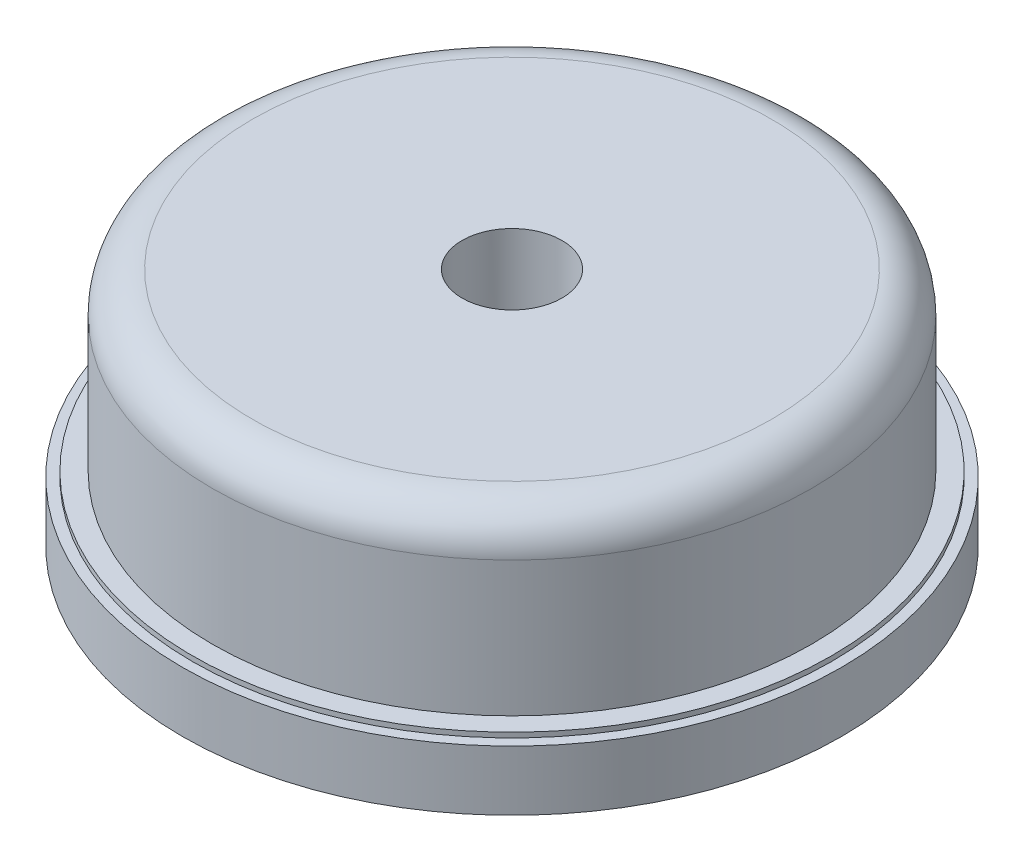
ISO-10303-21;
HEADER;
FILE_DESCRIPTION(('STEP AP214'),'2;1');
FILE_NAME('part.step','',(''),(''),'','','');
FILE_SCHEMA(('AUTOMOTIVE_DESIGN { 1 0 10303 214 1 1 1 1 }'));
ENDSEC;
DATA;
#1=APPLICATION_CONTEXT('core data for automotive mechanical design processes');
#2=APPLICATION_PROTOCOL_DEFINITION('international standard','automotive_design',2000,#1);
#3=PRODUCT_CONTEXT('',#1,'mechanical');
#4=PRODUCT('Part','Part','',(#3));
#5=PRODUCT_RELATED_PRODUCT_CATEGORY('part','',(#4));
#6=PRODUCT_DEFINITION_FORMATION('','',#4);
#7=PRODUCT_DEFINITION_CONTEXT('part definition',#1,'design');
#8=PRODUCT_DEFINITION('design','',#6,#7);
#9=PRODUCT_DEFINITION_SHAPE('','',#8);
#10=(LENGTH_UNIT() NAMED_UNIT(*) SI_UNIT(.MILLI.,.METRE.));
#11=(NAMED_UNIT(*) PLANE_ANGLE_UNIT() SI_UNIT($,.RADIAN.));
#12=(NAMED_UNIT(*) SI_UNIT($,.STERADIAN.) SOLID_ANGLE_UNIT());
#13=UNCERTAINTY_MEASURE_WITH_UNIT(LENGTH_MEASURE(1.E-05),#10,'distance_accuracy_value','');
#14=(GEOMETRIC_REPRESENTATION_CONTEXT(3) GLOBAL_UNCERTAINTY_ASSIGNED_CONTEXT((#13)) GLOBAL_UNIT_ASSIGNED_CONTEXT((#10,
#11,#12)) REPRESENTATION_CONTEXT('',''));
#15=CARTESIAN_POINT('',(0.,0.,0.));
#16=DIRECTION('',(0.,0.,1.));
#17=DIRECTION('',(1.,0.,0.));
#18=AXIS2_PLACEMENT_3D('',#15,#16,#17);
#19=CARTESIAN_POINT('',(-0.7812271897135,0.,0.6242468086041));
#20=DIRECTION('',(0.,-1.,0.));
#21=DIRECTION('',(-1.,0.,0.));
#22=AXIS2_PLACEMENT_3D('',#19,#20,#21);
#23=CYLINDRICAL_SURFACE('',#22,0.05);
#24=CARTESIAN_POINT('',(-0.7812271897135,0.,0.6242468086041));
#25=DIRECTION('',(0.,-1.,0.));
#26=DIRECTION('',(-0.781227189713479,0.,0.624246808604081));
#27=AXIS2_PLACEMENT_3D('',#24,#25,#26);
#28=CIRCLE('',#27,0.05);
#29=CARTESIAN_POINT('',(-0.8202885491992,0.,0.6554591490343));
#30=VERTEX_POINT('',#29);
#31=CARTESIAN_POINT('',(-0.8062271897135,0.,0.5809455384148));
#32=VERTEX_POINT('',#31);
#33=EDGE_CURVE('E10',#30,#32,#28,.T.);
#34=ORIENTED_EDGE('',*,*,#33,.T.);
#35=DIRECTION('',(0.,-1.,0.));
#36=VECTOR('',#35,1.);
#37=CARTESIAN_POINT('',(-0.8062271897135,0.,0.5809455384148));
#38=LINE('',#37,#36);
#39=CARTESIAN_POINT('',(-0.8062271897135,-0.002,0.5809455384148));
#40=VERTEX_POINT('',#39);
#41=EDGE_CURVE('E213',#32,#40,#38,.T.);
#42=ORIENTED_EDGE('',*,*,#41,.T.);
#43=CARTESIAN_POINT('',(-0.7812271897135,-0.002,0.6242468086041));
#44=DIRECTION('',(0.,-1.,0.));
#45=DIRECTION('',(-0.781227189713479,0.,0.624246808604081));
#46=AXIS2_PLACEMENT_3D('',#43,#44,#45);
#47=CIRCLE('',#46,0.05);
#48=CARTESIAN_POINT('',(-0.8202885491992,-0.002,0.6554591490343));
#49=VERTEX_POINT('',#48);
#50=EDGE_CURVE('E280',#49,#40,#47,.T.);
#51=ORIENTED_EDGE('',*,*,#50,.F.);
#52=DIRECTION('',(-1.110223024625E-13,-1.,0.));
#53=VECTOR('',#52,1.);
#54=CARTESIAN_POINT('',(-0.8202885491992,0.,0.6554591490343));
#55=LINE('',#54,#53);
#56=EDGE_CURVE('E35',#30,#49,#55,.T.);
#57=ORIENTED_EDGE('',*,*,#56,.F.);
#58=EDGE_LOOP('',(#34,#42,#51,#57));
#59=FACE_BOUND('',#58,.T.);
#60=ADVANCED_FACE('F16',(#59),#23,.T.);
#61=CARTESIAN_POINT('',(0.,0.,0.));
#62=DIRECTION('',(0.,-1.,0.));
#63=DIRECTION('',(-1.,0.,0.));
#64=AXIS2_PLACEMENT_3D('',#61,#62,#63);
#65=CYLINDRICAL_SURFACE('',#64,0.7);
#66=CARTESIAN_POINT('',(0.,0.,0.));
#67=DIRECTION('',(0.,-1.,0.));
#68=DIRECTION('',(-0.948528137262549,0.,0.316692868282883));
#69=AXIS2_PLACEMENT_3D('',#66,#67,#68);
#70=CIRCLE('',#69,0.7);
#71=CARTESIAN_POINT('',(-0.6639696960838,0.,0.221685007798));
#72=VERTEX_POINT('',#71);
#73=CARTESIAN_POINT('',(-0.1399999999999,0.,-0.6858571279793));
#74=VERTEX_POINT('',#73);
#75=EDGE_CURVE('E391',#72,#74,#70,.T.);
#76=ORIENTED_EDGE('',*,*,#75,.F.);
#77=DIRECTION('',(0.,-1.,0.));
#78=VECTOR('',#77,1.);
#79=CARTESIAN_POINT('',(-0.6639696960838,0.,0.221685007798));
#80=LINE('',#79,#78);
#81=CARTESIAN_POINT('',(-0.6639696960838,-0.002,0.221685007798));
#82=VERTEX_POINT('',#81);
#83=EDGE_CURVE('E331',#72,#82,#80,.T.);
#84=ORIENTED_EDGE('',*,*,#83,.T.);
#85=CARTESIAN_POINT('',(0.,-0.002,0.));
#86=DIRECTION('',(0.,1.,0.));
#87=DIRECTION('',(-0.199999999999898,0.,-0.979795897113292));
#88=AXIS2_PLACEMENT_3D('',#85,#86,#87);
#89=CIRCLE('',#88,0.7);
#90=CARTESIAN_POINT('',(-0.1399999999999,-0.002,-0.6858571279793));
#91=VERTEX_POINT('',#90);
#92=EDGE_CURVE('E256',#91,#82,#89,.T.);
#93=ORIENTED_EDGE('',*,*,#92,.F.);
#94=DIRECTION('',(1.665334536938E-13,-1.,0.));
#95=VECTOR('',#94,1.);
#96=CARTESIAN_POINT('',(-0.1399999999999,0.,-0.6858571279793));
#97=LINE('',#96,#95);
#98=EDGE_CURVE('E333',#74,#91,#97,.T.);
#99=ORIENTED_EDGE('',*,*,#98,.F.);
#100=EDGE_LOOP('',(#76,#84,#93,#99));
#101=FACE_BOUND('',#100,.T.);
#102=ADVANCED_FACE('F427',(#101),#65,.F.);
#103=CARTESIAN_POINT('',(0.,0.,0.));
#104=DIRECTION('',(0.,-1.,0.));
#105=DIRECTION('',(-1.,0.,0.));
#106=AXIS2_PLACEMENT_3D('',#103,#104,#105);
#107=CYLINDRICAL_SURFACE('',#106,1.05);
#108=CARTESIAN_POINT('',(0.,0.,0.));
#109=DIRECTION('',(0.,-1.,0.));
#110=DIRECTION('',(-0.931227189339217,0.,0.364439188117007));
#111=AXIS2_PLACEMENT_3D('',#108,#109,#110);
#112=CIRCLE('',#111,1.05);
#113=CARTESIAN_POINT('',(-0.9777885488062,0.,0.3826611475228));
#114=VERTEX_POINT('',#113);
#115=CARTESIAN_POINT('',(-0.1574999999999,0.,-1.038120296497));
#116=VERTEX_POINT('',#115);
#117=EDGE_CURVE('E26',#114,#116,#112,.T.);
#118=ORIENTED_EDGE('',*,*,#117,.T.);
#119=DIRECTION('',(0.,-1.,0.));
#120=VECTOR('',#119,1.);
#121=CARTESIAN_POINT('',(-0.1574999999999,0.,-1.038120296497));
#122=LINE('',#121,#120);
#123=CARTESIAN_POINT('',(-0.1574999999999,-0.002,-1.038120296497));
#124=VERTEX_POINT('',#123);
#125=EDGE_CURVE('E319',#116,#124,#122,.T.);
#126=ORIENTED_EDGE('',*,*,#125,.T.);
#127=CARTESIAN_POINT('',(0.,-0.002,0.));
#128=DIRECTION('',(0.,-1.,0.));
#129=DIRECTION('',(-0.931227189339217,0.,0.364439188117007));
#130=AXIS2_PLACEMENT_3D('',#127,#128,#129);
#131=CIRCLE('',#130,1.05);
#132=CARTESIAN_POINT('',(-0.9777885488062,-0.002,0.3826611475228));
#133=VERTEX_POINT('',#132);
#134=EDGE_CURVE('E266',#133,#124,#131,.T.);
#135=ORIENTED_EDGE('',*,*,#134,.F.);
#136=DIRECTION('',(0.,-1.,0.));
#137=VECTOR('',#136,1.);
#138=CARTESIAN_POINT('',(-0.9777885488062,0.,0.3826611475228));
#139=LINE('',#138,#137);
#140=EDGE_CURVE('E322',#114,#133,#139,.T.);
#141=ORIENTED_EDGE('',*,*,#140,.F.);
#142=EDGE_LOOP('',(#118,#126,#135,#141));
#143=FACE_BOUND('',#142,.T.);
#144=ADVANCED_FACE('F432',(#143),#107,.T.);
#145=CARTESIAN_POINT('',(0.7113961029469,0.,0.2375196512121));
#146=DIRECTION('',(0.,-1.,0.));
#147=DIRECTION('',(-1.,0.,0.));
#148=AXIS2_PLACEMENT_3D('',#145,#146,#147);
#149=CYLINDRICAL_SURFACE('',#148,0.05);
#150=CARTESIAN_POINT('',(0.7113961029469,0.,0.2375196512121));
#151=DIRECTION('',(0.,-1.,0.));
#152=DIRECTION('',(-0.500000000000017,0.,0.866025403784429));
#153=AXIS2_PLACEMENT_3D('',#150,#151,#152);
#154=CIRCLE('',#153,0.05);
#155=CARTESIAN_POINT('',(0.6863961029469,0.,0.2808209214013));
#156=VERTEX_POINT('',#155);
#157=CARTESIAN_POINT('',(0.6639696960838,0.,0.221685007798));
#158=VERTEX_POINT('',#157);
#159=EDGE_CURVE('E348',#156,#158,#154,.T.);
#160=ORIENTED_EDGE('',*,*,#159,.T.);
#161=DIRECTION('',(0.,-1.,-2.081668171172E-13));
#162=VECTOR('',#161,1.);
#163=CARTESIAN_POINT('',(0.6639696960838,0.,0.221685007798));
#164=LINE('',#163,#162);
#165=CARTESIAN_POINT('',(0.6639696960838,-0.002,0.221685007798));
#166=VERTEX_POINT('',#165);
#167=EDGE_CURVE('E298',#158,#166,#164,.T.);
#168=ORIENTED_EDGE('',*,*,#167,.T.);
#169=CARTESIAN_POINT('',(0.7113961029469,-0.002,0.2375196512121));
#170=DIRECTION('',(0.,-1.,0.));
#171=DIRECTION('',(-0.500000000000017,0.,0.866025403784429));
#172=AXIS2_PLACEMENT_3D('',#169,#170,#171);
#173=CIRCLE('',#172,0.05);
#174=CARTESIAN_POINT('',(0.6863961029469,-0.002,0.2808209214013));
#175=VERTEX_POINT('',#174);
#176=EDGE_CURVE('E241',#175,#166,#173,.T.);
#177=ORIENTED_EDGE('',*,*,#176,.F.);
#178=DIRECTION('',(0.,-1.,0.));
#179=VECTOR('',#178,1.);
#180=CARTESIAN_POINT('',(0.6863961029469,0.,0.2808209214013));
#181=LINE('',#180,#179);
#182=EDGE_CURVE('E301',#156,#175,#181,.T.);
#183=ORIENTED_EDGE('',*,*,#182,.F.);
#184=EDGE_LOOP('',(#160,#168,#177,#183));
#185=FACE_BOUND('',#184,.T.);
#186=ADVANCED_FACE('F437',(#185),#149,.T.);
#187=CARTESIAN_POINT('',(0.,0.,0.));
#188=DIRECTION('',(0.,-1.,0.));
#189=DIRECTION('',(-1.,0.,0.));
#190=AXIS2_PLACEMENT_3D('',#187,#188,#189);
#191=CYLINDRICAL_SURFACE('',#190,0.35);
#192=CARTESIAN_POINT('',(0.,-0.002,0.));
#193=DIRECTION('',(0.,-1.,0.));
#194=DIRECTION('',(-1.,0.,0.));
#195=AXIS2_PLACEMENT_3D('',#192,#193,#194);
#196=CIRCLE('',#195,0.35);
#197=CARTESIAN_POINT('',(-0.35,-0.002,0.));
#198=VERTEX_POINT('',#197);
#199=EDGE_CURVE('E234',#198,#198,#196,.T.);
#200=ORIENTED_EDGE('',*,*,#199,.F.);
#201=EDGE_LOOP('',(#200));
#202=FACE_BOUND('',#201,.T.);
#203=CARTESIAN_POINT('',(0.,0.,0.));
#204=DIRECTION('',(0.,-1.,0.));
#205=DIRECTION('',(1.,0.,0.));
#206=AXIS2_PLACEMENT_3D('',#203,#204,#205);
#207=CIRCLE('',#206,0.35);
#208=CARTESIAN_POINT('',(0.35,0.,0.));
#209=VERTEX_POINT('',#208);
#210=EDGE_CURVE('E352',#209,#209,#207,.T.);
#211=ORIENTED_EDGE('',*,*,#210,.T.);
#212=EDGE_LOOP('',(#211));
#213=FACE_BOUND('',#212,.T.);
#214=ADVANCED_FACE('F441',(#202,#213),#191,.T.);
#215=CARTESIAN_POINT('',(0.,1.2,0.));
#216=DIRECTION('',(0.,1.,0.));
#217=DIRECTION('',(1.,0.,0.));
#218=AXIS2_PLACEMENT_3D('',#215,#216,#217);
#219=CYLINDRICAL_SURFACE('',#218,0.25);
#220=CARTESIAN_POINT('',(0.,1.2,0.));
#221=DIRECTION('',(0.,1.,0.));
#222=DIRECTION('',(-1.,0.,0.));
#223=AXIS2_PLACEMENT_3D('',#220,#221,#222);
#224=CIRCLE('',#223,0.25);
#225=CARTESIAN_POINT('',(-0.25,1.2,0.));
#226=VERTEX_POINT('',#225);
#227=EDGE_CURVE('E357',#226,#226,#224,.T.);
#228=ORIENTED_EDGE('',*,*,#227,.T.);
#229=EDGE_LOOP('',(#228));
#230=FACE_BOUND('',#229,.T.);
#231=CARTESIAN_POINT('',(0.,0.8,0.));
#232=DIRECTION('',(0.,1.,0.));
#233=DIRECTION('',(1.,0.,0.));
#234=AXIS2_PLACEMENT_3D('',#231,#232,#233);
#235=CIRCLE('',#234,0.25);
#236=CARTESIAN_POINT('',(0.25,0.8,0.));
#237=VERTEX_POINT('',#236);
#238=EDGE_CURVE('E360',#237,#237,#235,.T.);
#239=ORIENTED_EDGE('',*,*,#238,.F.);
#240=EDGE_LOOP('',(#239));
#241=FACE_BOUND('',#240,.T.);
#242=ADVANCED_FACE('F445',(#230,#241),#219,.F.);
#243=CARTESIAN_POINT('',(0.,1.,0.));
#244=DIRECTION('',(0.,1.,0.));
#245=DIRECTION('',(0.999987797864378,0.,0.00494005286944589));
#246=AXIS2_PLACEMENT_3D('',#243,#244,#245);
#247=TOROIDAL_SURFACE('',#246,1.3,0.2);
#248=CARTESIAN_POINT('',(0.,1.2,0.));
#249=DIRECTION('',(0.,1.,0.));
#250=DIRECTION('',(1.,0.,0.));
#251=AXIS2_PLACEMENT_3D('',#248,#249,#250);
#252=CIRCLE('',#251,1.3);
#253=CARTESIAN_POINT('',(1.3,1.2,0.));
#254=VERTEX_POINT('',#253);
#255=EDGE_CURVE('E363',#254,#254,#252,.T.);
#256=ORIENTED_EDGE('',*,*,#255,.F.);
#257=EDGE_LOOP('',(#256));
#258=FACE_BOUND('',#257,.T.);
#259=CARTESIAN_POINT('',(0.,1.,0.));
#260=DIRECTION('',(0.,1.,0.));
#261=DIRECTION('',(1.,0.,0.));
#262=AXIS2_PLACEMENT_3D('',#259,#260,#261);
#263=CIRCLE('',#262,1.5);
#264=CARTESIAN_POINT('',(1.5,1.,0.));
#265=VERTEX_POINT('',#264);
#266=EDGE_CURVE('E366',#265,#265,#263,.T.);
#267=ORIENTED_EDGE('',*,*,#266,.T.);
#268=EDGE_LOOP('',(#267));
#269=FACE_BOUND('',#268,.T.);
#270=ADVANCED_FACE('F449',(#258,#269),#247,.T.);
#271=CARTESIAN_POINT('',(0.,0.3,0.));
#272=DIRECTION('',(0.,1.,0.));
#273=DIRECTION('',(1.,0.,0.));
#274=AXIS2_PLACEMENT_3D('',#271,#272,#273);
#275=CYLINDRICAL_SURFACE('',#274,1.5);
#276=ORIENTED_EDGE('',*,*,#266,.F.);
#277=EDGE_LOOP('',(#276));
#278=FACE_BOUND('',#277,.T.);
#279=CARTESIAN_POINT('',(0.,0.325,0.));
#280=DIRECTION('',(0.,1.,0.));
#281=DIRECTION('',(-1.,0.,0.));
#282=AXIS2_PLACEMENT_3D('',#279,#280,#281);
#283=CIRCLE('',#282,1.5);
#284=CARTESIAN_POINT('',(-1.5,0.325,0.));
#285=VERTEX_POINT('',#284);
#286=EDGE_CURVE('E369',#285,#285,#283,.T.);
#287=ORIENTED_EDGE('',*,*,#286,.T.);
#288=EDGE_LOOP('',(#287));
#289=FACE_BOUND('',#288,.T.);
#290=ADVANCED_FACE('F453',(#278,#289),#275,.T.);
#291=CARTESIAN_POINT('',(0.,0.3,0.));
#292=DIRECTION('',(0.,1.,0.));
#293=DIRECTION('',(0.,0.,1.));
#294=AXIS2_PLACEMENT_3D('',#291,#292,#293);
#295=CYLINDRICAL_SURFACE('',#294,1.6);
#296=CARTESIAN_POINT('',(0.,0.325,0.));
#297=DIRECTION('',(0.,1.,0.));
#298=DIRECTION('',(1.,0.,0.));
#299=AXIS2_PLACEMENT_3D('',#296,#297,#298);
#300=CIRCLE('',#299,1.6);
#301=CARTESIAN_POINT('',(1.6,0.325,0.));
#302=VERTEX_POINT('',#301);
#303=EDGE_CURVE('E372',#302,#302,#300,.T.);
#304=ORIENTED_EDGE('',*,*,#303,.F.);
#305=EDGE_LOOP('',(#304));
#306=FACE_BOUND('',#305,.T.);
#307=CARTESIAN_POINT('',(0.,0.3,0.));
#308=DIRECTION('',(0.,1.,0.));
#309=DIRECTION('',(-1.,0.,0.));
#310=AXIS2_PLACEMENT_3D('',#307,#308,#309);
#311=CIRCLE('',#310,1.6);
#312=CARTESIAN_POINT('',(-1.6,0.3,0.));
#313=VERTEX_POINT('',#312);
#314=EDGE_CURVE('E375',#313,#313,#311,.T.);
#315=ORIENTED_EDGE('',*,*,#314,.T.);
#316=EDGE_LOOP('',(#315));
#317=FACE_BOUND('',#316,.T.);
#318=ADVANCED_FACE('F457',(#306,#317),#295,.T.);
#319=CARTESIAN_POINT('',(0.,0.,0.));
#320=DIRECTION('',(0.,1.,0.));
#321=DIRECTION('',(1.,0.,0.));
#322=AXIS2_PLACEMENT_3D('',#319,#320,#321);
#323=CYLINDRICAL_SURFACE('',#322,1.65);
#324=CARTESIAN_POINT('',(0.,0.3,0.));
#325=DIRECTION('',(0.,1.,0.));
#326=DIRECTION('',(1.,0.,0.));
#327=AXIS2_PLACEMENT_3D('',#324,#325,#326);
#328=CIRCLE('',#327,1.65);
#329=CARTESIAN_POINT('',(1.65,0.3,0.));
#330=VERTEX_POINT('',#329);
#331=EDGE_CURVE('E381',#330,#330,#328,.T.);
#332=ORIENTED_EDGE('',*,*,#331,.F.);
#333=EDGE_LOOP('',(#332));
#334=FACE_BOUND('',#333,.T.);
#335=CARTESIAN_POINT('',(0.,0.,0.));
#336=DIRECTION('',(0.,1.,0.));
#337=DIRECTION('',(-1.,0.,0.));
#338=AXIS2_PLACEMENT_3D('',#335,#336,#337);
#339=CIRCLE('',#338,1.65);
#340=CARTESIAN_POINT('',(-1.65,0.,0.));
#341=VERTEX_POINT('',#340);
#342=EDGE_CURVE('E378',#341,#341,#339,.T.);
#343=ORIENTED_EDGE('',*,*,#342,.T.);
#344=EDGE_LOOP('',(#343));
#345=FACE_BOUND('',#344,.T.);
#346=ADVANCED_FACE('F461',(#334,#345),#323,.T.);
#347=CARTESIAN_POINT('',(0.,0.,0.));
#348=DIRECTION('',(0.,1.,0.));
#349=DIRECTION('',(1.,0.,0.));
#350=AXIS2_PLACEMENT_3D('',#347,#348,#349);
#351=PLANE('',#350);
#352=ORIENTED_EDGE('',*,*,#342,.F.);
#353=EDGE_LOOP('',(#352));
#354=FACE_BOUND('',#353,.T.);
#355=ORIENTED_EDGE('',*,*,#210,.F.);
#356=EDGE_LOOP('',(#355));
#357=FACE_BOUND('',#356,.T.);
#358=DIRECTION('',(0.,0.,-1.));
#359=VECTOR('',#358,1.);
#360=CARTESIAN_POINT('',(0.09999999999994,0.,-0.734846922835));
#361=LINE('',#360,#359);
#362=CARTESIAN_POINT('',(0.09999999999994,0.,-0.734846922835));
#363=VERTEX_POINT('',#362);
#364=CARTESIAN_POINT('',(0.09999999999994,0.,-0.9886859966643));
#365=VERTEX_POINT('',#364);
#366=EDGE_CURVE('E290',#363,#365,#361,.T.);
#367=ORIENTED_EDGE('',*,*,#366,.F.);
#368=CARTESIAN_POINT('',(0.1499999999999,0.,-0.734846922835));
#369=DIRECTION('',(0.,-1.,0.));
#370=DIRECTION('',(-0.199999999999899,0.,0.979795897113292));
#371=AXIS2_PLACEMENT_3D('',#368,#369,#370);
#372=CIRCLE('',#371,0.05);
#373=CARTESIAN_POINT('',(0.1399999999999,0.,-0.6858571279793));
#374=VERTEX_POINT('',#373);
#375=EDGE_CURVE('E294',#374,#363,#372,.T.);
#376=ORIENTED_EDGE('',*,*,#375,.F.);
#377=CARTESIAN_POINT('',(0.,0.,0.));
#378=DIRECTION('',(0.,-1.,0.));
#379=DIRECTION('',(0.199999999999898,0.,-0.979795897113292));
#380=AXIS2_PLACEMENT_3D('',#377,#378,#379);
#381=CIRCLE('',#380,0.7);
#382=EDGE_CURVE('E384',#374,#158,#381,.T.);
#383=ORIENTED_EDGE('',*,*,#382,.T.);
#384=ORIENTED_EDGE('',*,*,#159,.F.);
#385=DIRECTION('',(-0.866025403784429,0.,-0.500000000000017));
#386=VECTOR('',#385,1.);
#387=CARTESIAN_POINT('',(0.9062271893392,0.,0.4077404583062));
#388=LINE('',#387,#386);
#389=CARTESIAN_POINT('',(0.9062271893392,0.,0.4077404583062));
#390=VERTEX_POINT('',#389);
#391=EDGE_CURVE('E305',#390,#156,#388,.T.);
#392=ORIENTED_EDGE('',*,*,#391,.F.);
#393=CARTESIAN_POINT('',(0.9312271893392,0.,0.364439188117));
#394=DIRECTION('',(0.,-1.,0.));
#395=DIRECTION('',(0.93122718933925,0.,0.364439188116921));
#396=AXIS2_PLACEMENT_3D('',#393,#394,#395);
#397=CIRCLE('',#396,0.05);
#398=CARTESIAN_POINT('',(0.9777885488062,0.,0.3826611475228));
#399=VERTEX_POINT('',#398);
#400=EDGE_CURVE('E306',#399,#390,#397,.T.);
#401=ORIENTED_EDGE('',*,*,#400,.F.);
#402=CARTESIAN_POINT('',(0.,0.,0.));
#403=DIRECTION('',(0.,-1.,0.));
#404=DIRECTION('',(0.149999999999896,0.,-0.988685996664275));
#405=AXIS2_PLACEMENT_3D('',#402,#403,#404);
#406=CIRCLE('',#405,1.05);
#407=CARTESIAN_POINT('',(0.1574999999999,0.,-1.038120296497));
#408=VERTEX_POINT('',#407);
#409=EDGE_CURVE('E310',#408,#399,#406,.T.);
#410=ORIENTED_EDGE('',*,*,#409,.F.);
#411=CARTESIAN_POINT('',(0.1499999999999,0.,-0.9886859966643));
#412=DIRECTION('',(0.,-1.,0.));
#413=DIRECTION('',(-1.,0.,0.));
#414=AXIS2_PLACEMENT_3D('',#411,#412,#413);
#415=CIRCLE('',#414,0.05);
#416=EDGE_CURVE('E286',#365,#408,#415,.T.);
#417=ORIENTED_EDGE('',*,*,#416,.F.);
#418=EDGE_LOOP('',(#367,#376,#383,#384,#392,#401,#410,#417));
#419=FACE_BOUND('',#418,.T.);
#420=CARTESIAN_POINT('',(-0.1499999999999,0.,-0.9886859966643));
#421=DIRECTION('',(0.,-1.,0.));
#422=DIRECTION('',(-0.149999999999994,0.,-0.98868599666426));
#423=AXIS2_PLACEMENT_3D('',#420,#421,#422);
#424=CIRCLE('',#423,0.05);
#425=CARTESIAN_POINT('',(-0.09999999999994,0.,-0.9886859966643));
#426=VERTEX_POINT('',#425);
#427=EDGE_CURVE('E318',#116,#426,#424,.T.);
#428=ORIENTED_EDGE('',*,*,#427,.F.);
#429=ORIENTED_EDGE('',*,*,#117,.F.);
#430=CARTESIAN_POINT('',(-0.9312271893392,0.,0.364439188117));
#431=DIRECTION('',(0.,-1.,0.));
#432=DIRECTION('',(0.500000000000016,0.,0.866025403784429));
#433=AXIS2_PLACEMENT_3D('',#430,#431,#432);
#434=CIRCLE('',#433,0.05);
#435=CARTESIAN_POINT('',(-0.9062271893392,0.,0.4077404583062));
#436=VERTEX_POINT('',#435);
#437=EDGE_CURVE('E326',#436,#114,#434,.T.);
#438=ORIENTED_EDGE('',*,*,#437,.F.);
#439=DIRECTION('',(-0.866025403784429,0.,0.500000000000017));
#440=VECTOR('',#439,1.);
#441=CARTESIAN_POINT('',(-0.6863961029469,0.,0.2808209214014));
#442=LINE('',#441,#440);
#443=CARTESIAN_POINT('',(-0.6863961029469,0.,0.2808209214014));
#444=VERTEX_POINT('',#443);
#445=EDGE_CURVE('E327',#444,#436,#442,.T.);
#446=ORIENTED_EDGE('',*,*,#445,.F.);
#447=CARTESIAN_POINT('',(-0.7113961029469,0.,0.2375196512121));
#448=DIRECTION('',(0.,-1.,0.));
#449=DIRECTION('',(0.948528137262549,0.,-0.316692868282883));
#450=AXIS2_PLACEMENT_3D('',#447,#448,#449);
#451=CIRCLE('',#450,0.05);
#452=EDGE_CURVE('E330',#72,#444,#451,.T.);
#453=ORIENTED_EDGE('',*,*,#452,.F.);
#454=ORIENTED_EDGE('',*,*,#75,.T.);
#455=CARTESIAN_POINT('',(-0.1499999999999,0.,-0.734846922835));
#456=DIRECTION('',(0.,-1.,0.));
#457=DIRECTION('',(1.,0.,0.));
#458=AXIS2_PLACEMENT_3D('',#455,#456,#457);
#459=CIRCLE('',#458,0.05);
#460=CARTESIAN_POINT('',(-0.09999999999994,0.,-0.734846922835));
#461=VERTEX_POINT('',#460);
#462=EDGE_CURVE('E338',#461,#74,#459,.T.);
#463=ORIENTED_EDGE('',*,*,#462,.F.);
#464=DIRECTION('',(0.,0.,1.));
#465=VECTOR('',#464,1.);
#466=CARTESIAN_POINT('',(-0.09999999999994,0.,-0.9886859966643));
#467=LINE('',#466,#465);
#468=EDGE_CURVE('E314',#426,#461,#467,.T.);
#469=ORIENTED_EDGE('',*,*,#468,.F.);
#470=EDGE_LOOP('',(#428,#429,#438,#446,#453,#454,#463,#469));
#471=FACE_BOUND('',#470,.T.);
#472=CARTESIAN_POINT('',(0.,0.,0.));
#473=DIRECTION('',(0.,-1.,0.));
#474=DIRECTION('',(0.748528137761585,0.,0.663103028932287));
#475=AXIS2_PLACEMENT_3D('',#472,#473,#474);
#476=CIRCLE('',#475,0.7);
#477=CARTESIAN_POINT('',(0.5239696964331,0.,0.4641721202526));
#478=VERTEX_POINT('',#477);
#479=CARTESIAN_POINT('',(-0.5239696964331,0.,0.4641721202526));
#480=VERTEX_POINT('',#479);
#481=EDGE_CURVE('E199',#478,#480,#476,.T.);
#482=ORIENTED_EDGE('',*,*,#481,.T.);
#483=CARTESIAN_POINT('',(-0.5613961033212,0.,0.4973272716992));
#484=DIRECTION('',(0.,-1.,0.));
#485=DIRECTION('',(-0.500000000000016,0.,-0.866025403784429));
#486=AXIS2_PLACEMENT_3D('',#483,#484,#485);
#487=CIRCLE('',#486,0.05);
#488=CARTESIAN_POINT('',(-0.5863961033212,0.,0.45402600151));
#489=VERTEX_POINT('',#488);
#490=EDGE_CURVE('E204',#489,#480,#487,.T.);
#491=ORIENTED_EDGE('',*,*,#490,.F.);
#492=DIRECTION('',(0.866025403784429,0.,-0.500000000000017));
#493=VECTOR('',#492,1.);
#494=CARTESIAN_POINT('',(-0.8062271897135,0.,0.5809455384148));
#495=LINE('',#494,#493);
#496=EDGE_CURVE('E212',#32,#489,#495,.T.);
#497=ORIENTED_EDGE('',*,*,#496,.F.);
#498=ORIENTED_EDGE('',*,*,#33,.F.);
#499=CARTESIAN_POINT('',(0.,0.,0.));
#500=DIRECTION('',(0.,-1.,0.));
#501=DIRECTION('',(0.781227189713478,0.,0.624246808604082));
#502=AXIS2_PLACEMENT_3D('',#499,#500,#501);
#503=CIRCLE('',#502,1.05);
#504=CARTESIAN_POINT('',(0.8202885491992,0.,0.6554591490343));
#505=VERTEX_POINT('',#504);
#506=EDGE_CURVE('E217',#505,#30,#503,.T.);
#507=ORIENTED_EDGE('',*,*,#506,.F.);
#508=CARTESIAN_POINT('',(0.7812271897135,0.,0.6242468086041));
#509=DIRECTION('',(0.,-1.,0.));
#510=DIRECTION('',(0.500000000000016,0.,-0.866025403784429));
#511=AXIS2_PLACEMENT_3D('',#508,#509,#510);
#512=CIRCLE('',#511,0.05);
#513=CARTESIAN_POINT('',(0.8062271897135,0.,0.5809455384148));
#514=VERTEX_POINT('',#513);
#515=EDGE_CURVE('E218',#514,#505,#512,.T.);
#516=ORIENTED_EDGE('',*,*,#515,.F.);
#517=DIRECTION('',(0.866025403784429,0.,0.500000000000017));
#518=VECTOR('',#517,1.);
#519=CARTESIAN_POINT('',(0.5863961033212,0.,0.45402600151));
#520=LINE('',#519,#518);
#521=CARTESIAN_POINT('',(0.5863961033212,0.,0.45402600151));
#522=VERTEX_POINT('',#521);
#523=EDGE_CURVE('E227',#522,#514,#520,.T.);
#524=ORIENTED_EDGE('',*,*,#523,.F.);
#525=CARTESIAN_POINT('',(0.5613961033212,0.,0.4973272716992));
#526=DIRECTION('',(0.,-1.,0.));
#527=DIRECTION('',(-0.748528137761585,0.,-0.663103028932287));
#528=AXIS2_PLACEMENT_3D('',#525,#526,#527);
#529=CIRCLE('',#528,0.05);
#530=EDGE_CURVE('E200',#478,#522,#529,.T.);
#531=ORIENTED_EDGE('',*,*,#530,.F.);
#532=EDGE_LOOP('',(#482,#491,#497,#498,#507,#516,#524,#531));
#533=FACE_BOUND('',#532,.T.);
#534=ADVANCED_FACE('F414',(#354,#357,#419,#471,#533),#351,.F.);
#535=CARTESIAN_POINT('',(0.,0.3,0.));
#536=DIRECTION('',(0.,1.,0.));
#537=DIRECTION('',(1.,0.,0.));
#538=AXIS2_PLACEMENT_3D('',#535,#536,#537);
#539=PLANE('',#538);
#540=ORIENTED_EDGE('',*,*,#331,.T.);
#541=EDGE_LOOP('',(#540));
#542=FACE_BOUND('',#541,.T.);
#543=ORIENTED_EDGE('',*,*,#314,.F.);
#544=EDGE_LOOP('',(#543));
#545=FACE_BOUND('',#544,.T.);
#546=ADVANCED_FACE('F468',(#542,#545),#539,.T.);
#547=CARTESIAN_POINT('',(0.,0.325,0.));
#548=DIRECTION('',(0.,1.,0.));
#549=DIRECTION('',(0.,0.,1.));
#550=AXIS2_PLACEMENT_3D('',#547,#548,#549);
#551=PLANE('',#550);
#552=ORIENTED_EDGE('',*,*,#303,.T.);
#553=EDGE_LOOP('',(#552));
#554=FACE_BOUND('',#553,.T.);
#555=ORIENTED_EDGE('',*,*,#286,.F.);
#556=EDGE_LOOP('',(#555));
#557=FACE_BOUND('',#556,.T.);
#558=ADVANCED_FACE('F472',(#554,#557),#551,.T.);
#559=CARTESIAN_POINT('',(0.,1.2,0.));
#560=DIRECTION('',(0.,1.,0.));
#561=DIRECTION('',(1.,0.,0.));
#562=AXIS2_PLACEMENT_3D('',#559,#560,#561);
#563=PLANE('',#562);
#564=ORIENTED_EDGE('',*,*,#255,.T.);
#565=EDGE_LOOP('',(#564));
#566=FACE_BOUND('',#565,.T.);
#567=ORIENTED_EDGE('',*,*,#227,.F.);
#568=EDGE_LOOP('',(#567));
#569=FACE_BOUND('',#568,.T.);
#570=ADVANCED_FACE('F476',(#566,#569),#563,.T.);
#571=CARTESIAN_POINT('',(0.,0.8,0.));
#572=DIRECTION('',(0.,1.,0.));
#573=DIRECTION('',(1.,0.,0.));
#574=AXIS2_PLACEMENT_3D('',#571,#572,#573);
#575=PLANE('',#574);
#576=ORIENTED_EDGE('',*,*,#238,.T.);
#577=EDGE_LOOP('',(#576));
#578=FACE_BOUND('',#577,.T.);
#579=ADVANCED_FACE('F480',(#578),#575,.T.);
#580=CARTESIAN_POINT('',(0.,-0.002,0.));
#581=DIRECTION('',(0.,-1.,0.));
#582=DIRECTION('',(-1.,0.,0.));
#583=AXIS2_PLACEMENT_3D('',#580,#581,#582);
#584=PLANE('',#583);
#585=ORIENTED_EDGE('',*,*,#199,.T.);
#586=EDGE_LOOP('',(#585));
#587=FACE_BOUND('',#586,.T.);
#588=ADVANCED_FACE('F484',(#587),#584,.T.);
#589=CARTESIAN_POINT('',(0.,-0.002,0.));
#590=DIRECTION('',(0.,-1.,0.));
#591=DIRECTION('',(-1.,0.,0.));
#592=AXIS2_PLACEMENT_3D('',#589,#590,#591);
#593=PLANE('',#592);
#594=CARTESIAN_POINT('',(0.,-0.002,0.));
#595=DIRECTION('',(0.,-1.,0.));
#596=DIRECTION('',(0.149999999999896,0.,-0.988685996664275));
#597=AXIS2_PLACEMENT_3D('',#594,#595,#596);
#598=CIRCLE('',#597,1.05);
#599=CARTESIAN_POINT('',(0.1574999999999,-0.002,-1.038120296497));
#600=VERTEX_POINT('',#599);
#601=CARTESIAN_POINT('',(0.9777885488062,-0.002,0.3826611475228));
#602=VERTEX_POINT('',#601);
#603=EDGE_CURVE('E231',#600,#602,#598,.T.);
#604=ORIENTED_EDGE('',*,*,#603,.T.);
#605=CARTESIAN_POINT('',(0.9312271893392,-0.002,0.364439188117));
#606=DIRECTION('',(0.,-1.,0.));
#607=DIRECTION('',(0.93122718933925,0.,0.364439188116921));
#608=AXIS2_PLACEMENT_3D('',#605,#606,#607);
#609=CIRCLE('',#608,0.05);
#610=CARTESIAN_POINT('',(0.9062271893392,-0.002,0.4077404583062));
#611=VERTEX_POINT('',#610);
#612=EDGE_CURVE('E235',#602,#611,#609,.T.);
#613=ORIENTED_EDGE('',*,*,#612,.T.);
#614=DIRECTION('',(-0.866025403784429,0.,-0.500000000000017));
#615=VECTOR('',#614,1.);
#616=CARTESIAN_POINT('',(0.9062271893392,-0.002,0.4077404583062));
#617=LINE('',#616,#615);
#618=EDGE_CURVE('E238',#611,#175,#617,.T.);
#619=ORIENTED_EDGE('',*,*,#618,.T.);
#620=ORIENTED_EDGE('',*,*,#176,.T.);
#621=CARTESIAN_POINT('',(0.,-0.002,0.));
#622=DIRECTION('',(0.,1.,0.));
#623=DIRECTION('',(0.948528137262579,0.,0.316692868282793));
#624=AXIS2_PLACEMENT_3D('',#621,#622,#623);
#625=CIRCLE('',#624,0.7);
#626=CARTESIAN_POINT('',(0.1399999999999,-0.002,-0.6858571279793));
#627=VERTEX_POINT('',#626);
#628=EDGE_CURVE('E242',#166,#627,#625,.T.);
#629=ORIENTED_EDGE('',*,*,#628,.T.);
#630=CARTESIAN_POINT('',(0.1499999999999,-0.002,-0.734846922835));
#631=DIRECTION('',(0.,-1.,0.));
#632=DIRECTION('',(-0.199999999999899,0.,0.979795897113292));
#633=AXIS2_PLACEMENT_3D('',#630,#631,#632);
#634=CIRCLE('',#633,0.05);
#635=CARTESIAN_POINT('',(0.09999999999994,-0.002,-0.734846922835));
#636=VERTEX_POINT('',#635);
#637=EDGE_CURVE('E245',#627,#636,#634,.T.);
#638=ORIENTED_EDGE('',*,*,#637,.T.);
#639=DIRECTION('',(0.,0.,-1.));
#640=VECTOR('',#639,1.);
#641=CARTESIAN_POINT('',(0.09999999999994,-0.002,-0.734846922835));
#642=LINE('',#641,#640);
#643=CARTESIAN_POINT('',(0.09999999999994,-0.002,-0.9886859966643));
#644=VERTEX_POINT('',#643);
#645=EDGE_CURVE('E248',#636,#644,#642,.T.);
#646=ORIENTED_EDGE('',*,*,#645,.T.);
#647=CARTESIAN_POINT('',(0.1499999999999,-0.002,-0.9886859966643));
#648=DIRECTION('',(0.,-1.,0.));
#649=DIRECTION('',(-1.,0.,0.));
#650=AXIS2_PLACEMENT_3D('',#647,#648,#649);
#651=CIRCLE('',#650,0.05);
#652=EDGE_CURVE('E251',#644,#600,#651,.T.);
#653=ORIENTED_EDGE('',*,*,#652,.T.);
#654=EDGE_LOOP('',(#604,#613,#619,#620,#629,#638,#646,#653));
#655=FACE_BOUND('',#654,.T.);
#656=ADVANCED_FACE('F488',(#655),#593,.T.);
#657=CARTESIAN_POINT('',(0.,-0.002,0.));
#658=DIRECTION('',(0.,-1.,0.));
#659=DIRECTION('',(-1.,0.,0.));
#660=AXIS2_PLACEMENT_3D('',#657,#658,#659);
#661=PLANE('',#660);
#662=CARTESIAN_POINT('',(-0.1499999999999,-0.002,-0.734846922835));
#663=DIRECTION('',(0.,-1.,0.));
#664=DIRECTION('',(1.,0.,0.));
#665=AXIS2_PLACEMENT_3D('',#662,#663,#664);
#666=CIRCLE('',#665,0.05);
#667=CARTESIAN_POINT('',(-0.09999999999994,-0.002,-0.734846922835));
#668=VERTEX_POINT('',#667);
#669=EDGE_CURVE('E253',#668,#91,#666,.T.);
#670=ORIENTED_EDGE('',*,*,#669,.T.);
#671=ORIENTED_EDGE('',*,*,#92,.T.);
#672=CARTESIAN_POINT('',(-0.7113961029469,-0.002,0.2375196512121));
#673=DIRECTION('',(0.,-1.,0.));
#674=DIRECTION('',(0.948528137262549,0.,-0.316692868282883));
#675=AXIS2_PLACEMENT_3D('',#672,#673,#674);
#676=CIRCLE('',#675,0.05);
#677=CARTESIAN_POINT('',(-0.6863961029469,-0.002,0.2808209214014));
#678=VERTEX_POINT('',#677);
#679=EDGE_CURVE('E257',#82,#678,#676,.T.);
#680=ORIENTED_EDGE('',*,*,#679,.T.);
#681=DIRECTION('',(-0.866025403784429,0.,0.500000000000017));
#682=VECTOR('',#681,1.);
#683=CARTESIAN_POINT('',(-0.6863961029469,-0.002,0.2808209214014));
#684=LINE('',#683,#682);
#685=CARTESIAN_POINT('',(-0.9062271893392,-0.002,0.4077404583062));
#686=VERTEX_POINT('',#685);
#687=EDGE_CURVE('E260',#678,#686,#684,.T.);
#688=ORIENTED_EDGE('',*,*,#687,.T.);
#689=CARTESIAN_POINT('',(-0.9312271893392,-0.002,0.364439188117));
#690=DIRECTION('',(0.,-1.,0.));
#691=DIRECTION('',(0.500000000000016,0.,0.866025403784429));
#692=AXIS2_PLACEMENT_3D('',#689,#690,#691);
#693=CIRCLE('',#692,0.05);
#694=EDGE_CURVE('E263',#686,#133,#693,.T.);
#695=ORIENTED_EDGE('',*,*,#694,.T.);
#696=ORIENTED_EDGE('',*,*,#134,.T.);
#697=CARTESIAN_POINT('',(-0.1499999999999,-0.002,-0.9886859966643));
#698=DIRECTION('',(0.,-1.,0.));
#699=DIRECTION('',(-0.149999999999994,0.,-0.98868599666426));
#700=AXIS2_PLACEMENT_3D('',#697,#698,#699);
#701=CIRCLE('',#700,0.05);
#702=CARTESIAN_POINT('',(-0.09999999999994,-0.002,-0.9886859966643));
#703=VERTEX_POINT('',#702);
#704=EDGE_CURVE('E267',#124,#703,#701,.T.);
#705=ORIENTED_EDGE('',*,*,#704,.T.);
#706=DIRECTION('',(0.,0.,1.));
#707=VECTOR('',#706,1.);
#708=CARTESIAN_POINT('',(-0.09999999999994,-0.002,-0.9886859966643));
#709=LINE('',#708,#707);
#710=EDGE_CURVE('E270',#703,#668,#709,.T.);
#711=ORIENTED_EDGE('',*,*,#710,.T.);
#712=EDGE_LOOP('',(#670,#671,#680,#688,#695,#696,#705,#711));
#713=FACE_BOUND('',#712,.T.);
#714=ADVANCED_FACE('F492',(#713),#661,.T.);
#715=CARTESIAN_POINT('',(0.,-0.002,0.));
#716=DIRECTION('',(0.,-1.,0.));
#717=DIRECTION('',(-1.,0.,0.));
#718=AXIS2_PLACEMENT_3D('',#715,#716,#717);
#719=PLANE('',#718);
#720=DIRECTION('',(0.866025403784429,0.,0.500000000000017));
#721=VECTOR('',#720,1.);
#722=CARTESIAN_POINT('',(0.5863961033212,-0.002,0.45402600151));
#723=LINE('',#722,#721);
#724=CARTESIAN_POINT('',(0.5863961033212,-0.002,0.45402600151));
#725=VERTEX_POINT('',#724);
#726=CARTESIAN_POINT('',(0.8062271897135,-0.002,0.5809455384148));
#727=VERTEX_POINT('',#726);
#728=EDGE_CURVE('E272',#725,#727,#723,.T.);
#729=ORIENTED_EDGE('',*,*,#728,.T.);
#730=CARTESIAN_POINT('',(0.7812271897135,-0.002,0.6242468086041));
#731=DIRECTION('',(0.,-1.,0.));
#732=DIRECTION('',(0.500000000000016,0.,-0.866025403784429));
#733=AXIS2_PLACEMENT_3D('',#730,#731,#732);
#734=CIRCLE('',#733,0.05);
#735=CARTESIAN_POINT('',(0.8202885491992,-0.002,0.6554591490343));
#736=VERTEX_POINT('',#735);
#737=EDGE_CURVE('E274',#727,#736,#734,.T.);
#738=ORIENTED_EDGE('',*,*,#737,.T.);
#739=CARTESIAN_POINT('',(0.,-0.002,0.));
#740=DIRECTION('',(0.,-1.,0.));
#741=DIRECTION('',(0.781227189713478,0.,0.624246808604082));
#742=AXIS2_PLACEMENT_3D('',#739,#740,#741);
#743=CIRCLE('',#742,1.05);
#744=EDGE_CURVE('E277',#736,#49,#743,.T.);
#745=ORIENTED_EDGE('',*,*,#744,.T.);
#746=ORIENTED_EDGE('',*,*,#50,.T.);
#747=DIRECTION('',(0.866025403784429,0.,-0.500000000000017));
#748=VECTOR('',#747,1.);
#749=CARTESIAN_POINT('',(-0.8062271897135,-0.002,0.5809455384148));
#750=LINE('',#749,#748);
#751=CARTESIAN_POINT('',(-0.5863961033212,-0.002,0.45402600151));
#752=VERTEX_POINT('',#751);
#753=EDGE_CURVE('E281',#40,#752,#750,.T.);
#754=ORIENTED_EDGE('',*,*,#753,.T.);
#755=CARTESIAN_POINT('',(-0.5613961033212,-0.002,0.4973272716992));
#756=DIRECTION('',(0.,-1.,0.));
#757=DIRECTION('',(-0.500000000000016,0.,-0.866025403784429));
#758=AXIS2_PLACEMENT_3D('',#755,#756,#757);
#759=CIRCLE('',#758,0.05);
#760=CARTESIAN_POINT('',(-0.5239696964331,-0.002,0.4641721202526));
#761=VERTEX_POINT('',#760);
#762=EDGE_CURVE('E193',#752,#761,#759,.T.);
#763=ORIENTED_EDGE('',*,*,#762,.T.);
#764=CARTESIAN_POINT('',(0.,-0.002,0.));
#765=DIRECTION('',(0.,1.,0.));
#766=DIRECTION('',(-0.748528137761585,0.,0.663103028932287));
#767=AXIS2_PLACEMENT_3D('',#764,#765,#766);
#768=CIRCLE('',#767,0.7);
#769=CARTESIAN_POINT('',(0.5239696964331,-0.002,0.4641721202526));
#770=VERTEX_POINT('',#769);
#771=EDGE_CURVE('E174',#761,#770,#768,.T.);
#772=ORIENTED_EDGE('',*,*,#771,.T.);
#773=CARTESIAN_POINT('',(0.5613961033212,-0.002,0.4973272716992));
#774=DIRECTION('',(0.,-1.,0.));
#775=DIRECTION('',(-0.748528137761585,0.,-0.663103028932287));
#776=AXIS2_PLACEMENT_3D('',#773,#774,#775);
#777=CIRCLE('',#776,0.05);
#778=EDGE_CURVE('E180',#770,#725,#777,.T.);
#779=ORIENTED_EDGE('',*,*,#778,.T.);
#780=EDGE_LOOP('',(#729,#738,#745,#746,#754,#763,#772,#779));
#781=FACE_BOUND('',#780,.T.);
#782=ADVANCED_FACE('F191',(#781),#719,.T.);
#783=CARTESIAN_POINT('',(0.1499999999999,0.,-0.9886859966643));
#784=DIRECTION('',(0.,-1.,0.));
#785=DIRECTION('',(-1.,0.,0.));
#786=AXIS2_PLACEMENT_3D('',#783,#784,#785);
#787=CYLINDRICAL_SURFACE('',#786,0.05);
#788=DIRECTION('',(0.,-1.,0.));
#789=VECTOR('',#788,1.);
#790=CARTESIAN_POINT('',(0.1574999999999,0.,-1.038120296497));
#791=LINE('',#790,#789);
#792=EDGE_CURVE('E189',#408,#600,#791,.T.);
#793=ORIENTED_EDGE('',*,*,#792,.T.);
#794=ORIENTED_EDGE('',*,*,#652,.F.);
#795=DIRECTION('',(0.,-1.,0.));
#796=VECTOR('',#795,1.);
#797=CARTESIAN_POINT('',(0.09999999999994,0.,-0.9886859966643));
#798=LINE('',#797,#796);
#799=EDGE_CURVE('E287',#365,#644,#798,.T.);
#800=ORIENTED_EDGE('',*,*,#799,.F.);
#801=ORIENTED_EDGE('',*,*,#416,.T.);
#802=EDGE_LOOP('',(#793,#794,#800,#801));
#803=FACE_BOUND('',#802,.T.);
#804=ADVANCED_FACE('F499',(#803),#787,.T.);
#805=CARTESIAN_POINT('',(0.09999999999994,0.,-0.734846922835));
#806=DIRECTION('',(-1.,0.,0.));
#807=DIRECTION('',(0.,0.,-1.));
#808=AXIS2_PLACEMENT_3D('',#805,#806,#807);
#809=PLANE('',#808);
#810=ORIENTED_EDGE('',*,*,#799,.T.);
#811=ORIENTED_EDGE('',*,*,#645,.F.);
#812=DIRECTION('',(0.,-1.,0.));
#813=VECTOR('',#812,1.);
#814=CARTESIAN_POINT('',(0.09999999999994,0.,-0.734846922835));
#815=LINE('',#814,#813);
#816=EDGE_CURVE('E291',#363,#636,#815,.T.);
#817=ORIENTED_EDGE('',*,*,#816,.F.);
#818=ORIENTED_EDGE('',*,*,#366,.T.);
#819=EDGE_LOOP('',(#810,#811,#817,#818));
#820=FACE_BOUND('',#819,.T.);
#821=ADVANCED_FACE('F502',(#820),#809,.T.);
#822=CARTESIAN_POINT('',(0.1499999999999,0.,-0.734846922835));
#823=DIRECTION('',(0.,-1.,0.));
#824=DIRECTION('',(-1.,0.,0.));
#825=AXIS2_PLACEMENT_3D('',#822,#823,#824);
#826=CYLINDRICAL_SURFACE('',#825,0.05);
#827=ORIENTED_EDGE('',*,*,#816,.T.);
#828=ORIENTED_EDGE('',*,*,#637,.F.);
#829=DIRECTION('',(0.,-1.,0.));
#830=VECTOR('',#829,1.);
#831=CARTESIAN_POINT('',(0.1399999999999,0.,-0.6858571279793));
#832=LINE('',#831,#830);
#833=EDGE_CURVE('E295',#374,#627,#832,.T.);
#834=ORIENTED_EDGE('',*,*,#833,.F.);
#835=ORIENTED_EDGE('',*,*,#375,.T.);
#836=EDGE_LOOP('',(#827,#828,#834,#835));
#837=FACE_BOUND('',#836,.T.);
#838=ADVANCED_FACE('F506',(#837),#826,.T.);
#839=CARTESIAN_POINT('',(0.,0.,0.));
#840=DIRECTION('',(0.,-1.,0.));
#841=DIRECTION('',(-1.,0.,0.));
#842=AXIS2_PLACEMENT_3D('',#839,#840,#841);
#843=CYLINDRICAL_SURFACE('',#842,0.7);
#844=ORIENTED_EDGE('',*,*,#833,.T.);
#845=ORIENTED_EDGE('',*,*,#628,.F.);
#846=ORIENTED_EDGE('',*,*,#167,.F.);
#847=ORIENTED_EDGE('',*,*,#382,.F.);
#848=EDGE_LOOP('',(#844,#845,#846,#847));
#849=FACE_BOUND('',#848,.T.);
#850=ADVANCED_FACE('F510',(#849),#843,.F.);
#851=CARTESIAN_POINT('',(0.9062271893392,0.,0.4077404583062));
#852=DIRECTION('',(-0.500000000000017,0.,0.866025403784429));
#853=DIRECTION('',(-0.866025403784429,0.,-0.500000000000017));
#854=AXIS2_PLACEMENT_3D('',#851,#852,#853);
#855=PLANE('',#854);
#856=ORIENTED_EDGE('',*,*,#182,.T.);
#857=ORIENTED_EDGE('',*,*,#618,.F.);
#858=DIRECTION('',(0.,-1.,0.));
#859=VECTOR('',#858,1.);
#860=CARTESIAN_POINT('',(0.9062271893392,0.,0.4077404583062));
#861=LINE('',#860,#859);
#862=EDGE_CURVE('E302',#390,#611,#861,.T.);
#863=ORIENTED_EDGE('',*,*,#862,.F.);
#864=ORIENTED_EDGE('',*,*,#391,.T.);
#865=EDGE_LOOP('',(#856,#857,#863,#864));
#866=FACE_BOUND('',#865,.T.);
#867=ADVANCED_FACE('F514',(#866),#855,.T.);
#868=CARTESIAN_POINT('',(0.9312271893392,0.,0.364439188117));
#869=DIRECTION('',(0.,-1.,0.));
#870=DIRECTION('',(-1.,0.,0.));
#871=AXIS2_PLACEMENT_3D('',#868,#869,#870);
#872=CYLINDRICAL_SURFACE('',#871,0.05);
#873=ORIENTED_EDGE('',*,*,#862,.T.);
#874=ORIENTED_EDGE('',*,*,#612,.F.);
#875=DIRECTION('',(0.,-1.,0.));
#876=VECTOR('',#875,1.);
#877=CARTESIAN_POINT('',(0.9777885488062,0.,0.3826611475228));
#878=LINE('',#877,#876);
#879=EDGE_CURVE('E307',#399,#602,#878,.T.);
#880=ORIENTED_EDGE('',*,*,#879,.F.);
#881=ORIENTED_EDGE('',*,*,#400,.T.);
#882=EDGE_LOOP('',(#873,#874,#880,#881));
#883=FACE_BOUND('',#882,.T.);
#884=ADVANCED_FACE('F518',(#883),#872,.T.);
#885=CARTESIAN_POINT('',(0.,0.,0.));
#886=DIRECTION('',(0.,-1.,0.));
#887=DIRECTION('',(-1.,0.,0.));
#888=AXIS2_PLACEMENT_3D('',#885,#886,#887);
#889=CYLINDRICAL_SURFACE('',#888,1.05);
#890=ORIENTED_EDGE('',*,*,#879,.T.);
#891=ORIENTED_EDGE('',*,*,#603,.F.);
#892=ORIENTED_EDGE('',*,*,#792,.F.);
#893=ORIENTED_EDGE('',*,*,#409,.T.);
#894=EDGE_LOOP('',(#890,#891,#892,#893));
#895=FACE_BOUND('',#894,.T.);
#896=ADVANCED_FACE('F522',(#895),#889,.T.);
#897=CARTESIAN_POINT('',(-0.09999999999994,0.,-0.9886859966643));
#898=DIRECTION('',(1.,0.,0.));
#899=DIRECTION('',(0.,0.,1.));
#900=AXIS2_PLACEMENT_3D('',#897,#898,#899);
#901=PLANE('',#900);
#902=DIRECTION('',(0.,-1.,0.));
#903=VECTOR('',#902,1.);
#904=CARTESIAN_POINT('',(-0.09999999999994,0.,-0.734846922835));
#905=LINE('',#904,#903);
#906=EDGE_CURVE('E311',#461,#668,#905,.T.);
#907=ORIENTED_EDGE('',*,*,#906,.T.);
#908=ORIENTED_EDGE('',*,*,#710,.F.);
#909=DIRECTION('',(0.,-1.,0.));
#910=VECTOR('',#909,1.);
#911=CARTESIAN_POINT('',(-0.09999999999994,0.,-0.9886859966643));
#912=LINE('',#911,#910);
#913=EDGE_CURVE('E315',#426,#703,#912,.T.);
#914=ORIENTED_EDGE('',*,*,#913,.F.);
#915=ORIENTED_EDGE('',*,*,#468,.T.);
#916=EDGE_LOOP('',(#907,#908,#914,#915));
#917=FACE_BOUND('',#916,.T.);
#918=ADVANCED_FACE('F526',(#917),#901,.T.);
#919=CARTESIAN_POINT('',(-0.1499999999999,0.,-0.9886859966643));
#920=DIRECTION('',(0.,-1.,0.));
#921=DIRECTION('',(-1.,0.,0.));
#922=AXIS2_PLACEMENT_3D('',#919,#920,#921);
#923=CYLINDRICAL_SURFACE('',#922,0.05);
#924=ORIENTED_EDGE('',*,*,#913,.T.);
#925=ORIENTED_EDGE('',*,*,#704,.F.);
#926=ORIENTED_EDGE('',*,*,#125,.F.);
#927=ORIENTED_EDGE('',*,*,#427,.T.);
#928=EDGE_LOOP('',(#924,#925,#926,#927));
#929=FACE_BOUND('',#928,.T.);
#930=ADVANCED_FACE('F530',(#929),#923,.T.);
#931=CARTESIAN_POINT('',(-0.9312271893392,0.,0.364439188117));
#932=DIRECTION('',(0.,-1.,0.));
#933=DIRECTION('',(-1.,0.,0.));
#934=AXIS2_PLACEMENT_3D('',#931,#932,#933);
#935=CYLINDRICAL_SURFACE('',#934,0.05);
#936=ORIENTED_EDGE('',*,*,#140,.T.);
#937=ORIENTED_EDGE('',*,*,#694,.F.);
#938=DIRECTION('',(0.,-1.,0.));
#939=VECTOR('',#938,1.);
#940=CARTESIAN_POINT('',(-0.9062271893392,0.,0.4077404583062));
#941=LINE('',#940,#939);
#942=EDGE_CURVE('E323',#436,#686,#941,.T.);
#943=ORIENTED_EDGE('',*,*,#942,.F.);
#944=ORIENTED_EDGE('',*,*,#437,.T.);
#945=EDGE_LOOP('',(#936,#937,#943,#944));
#946=FACE_BOUND('',#945,.T.);
#947=ADVANCED_FACE('F534',(#946),#935,.T.);
#948=CARTESIAN_POINT('',(-0.6863961029469,0.,0.2808209214014));
#949=DIRECTION('',(0.500000000000017,0.,0.866025403784429));
#950=DIRECTION('',(-0.866025403784429,0.,0.500000000000017));
#951=AXIS2_PLACEMENT_3D('',#948,#949,#950);
#952=PLANE('',#951);
#953=ORIENTED_EDGE('',*,*,#942,.T.);
#954=ORIENTED_EDGE('',*,*,#687,.F.);
#955=DIRECTION('',(0.,-1.,0.));
#956=VECTOR('',#955,1.);
#957=CARTESIAN_POINT('',(-0.6863961029469,0.,0.2808209214014));
#958=LINE('',#957,#956);
#959=EDGE_CURVE('E328',#444,#678,#958,.T.);
#960=ORIENTED_EDGE('',*,*,#959,.F.);
#961=ORIENTED_EDGE('',*,*,#445,.T.);
#962=EDGE_LOOP('',(#953,#954,#960,#961));
#963=FACE_BOUND('',#962,.T.);
#964=ADVANCED_FACE('F538',(#963),#952,.T.);
#965=CARTESIAN_POINT('',(-0.7113961029469,0.,0.2375196512121));
#966=DIRECTION('',(0.,-1.,0.));
#967=DIRECTION('',(-1.,0.,0.));
#968=AXIS2_PLACEMENT_3D('',#965,#966,#967);
#969=CYLINDRICAL_SURFACE('',#968,0.05);
#970=ORIENTED_EDGE('',*,*,#959,.T.);
#971=ORIENTED_EDGE('',*,*,#679,.F.);
#972=ORIENTED_EDGE('',*,*,#83,.F.);
#973=ORIENTED_EDGE('',*,*,#452,.T.);
#974=EDGE_LOOP('',(#970,#971,#972,#973));
#975=FACE_BOUND('',#974,.T.);
#976=ADVANCED_FACE('F542',(#975),#969,.T.);
#977=CARTESIAN_POINT('',(-0.1499999999999,0.,-0.734846922835));
#978=DIRECTION('',(0.,-1.,0.));
#979=DIRECTION('',(-1.,0.,0.));
#980=AXIS2_PLACEMENT_3D('',#977,#978,#979);
#981=CYLINDRICAL_SURFACE('',#980,0.05);
#982=ORIENTED_EDGE('',*,*,#98,.T.);
#983=ORIENTED_EDGE('',*,*,#669,.F.);
#984=ORIENTED_EDGE('',*,*,#906,.F.);
#985=ORIENTED_EDGE('',*,*,#462,.T.);
#986=EDGE_LOOP('',(#982,#983,#984,#985));
#987=FACE_BOUND('',#986,.T.);
#988=ADVANCED_FACE('F546',(#987),#981,.T.);
#989=CARTESIAN_POINT('',(0.5613961033212,0.,0.4973272716992));
#990=DIRECTION('',(0.,-1.,0.));
#991=DIRECTION('',(-1.,0.,0.));
#992=AXIS2_PLACEMENT_3D('',#989,#990,#991);
#993=CYLINDRICAL_SURFACE('',#992,0.05);
#994=DIRECTION('',(0.,-1.,0.));
#995=VECTOR('',#994,1.);
#996=CARTESIAN_POINT('',(0.5863961033212,0.,0.45402600151));
#997=LINE('',#996,#995);
#998=EDGE_CURVE('E185',#522,#725,#997,.T.);
#999=ORIENTED_EDGE('',*,*,#998,.T.);
#1000=ORIENTED_EDGE('',*,*,#778,.F.);
#1001=DIRECTION('',(0.,-1.,0.));
#1002=VECTOR('',#1001,1.);
#1003=CARTESIAN_POINT('',(0.5239696964331,0.,0.4641721202526));
#1004=LINE('',#1003,#1002);
#1005=EDGE_CURVE('E183',#478,#770,#1004,.T.);
#1006=ORIENTED_EDGE('',*,*,#1005,.F.);
#1007=ORIENTED_EDGE('',*,*,#530,.T.);
#1008=EDGE_LOOP('',(#999,#1000,#1006,#1007));
#1009=FACE_BOUND('',#1008,.T.);
#1010=ADVANCED_FACE('F181',(#1009),#993,.T.);
#1011=CARTESIAN_POINT('',(0.,0.,0.));
#1012=DIRECTION('',(0.,-1.,0.));
#1013=DIRECTION('',(-1.,0.,0.));
#1014=AXIS2_PLACEMENT_3D('',#1011,#1012,#1013);
#1015=CYLINDRICAL_SURFACE('',#1014,0.7);
#1016=ORIENTED_EDGE('',*,*,#1005,.T.);
#1017=ORIENTED_EDGE('',*,*,#771,.F.);
#1018=DIRECTION('',(0.,-1.,0.));
#1019=VECTOR('',#1018,1.);
#1020=CARTESIAN_POINT('',(-0.5239696964331,0.,0.4641721202526));
#1021=LINE('',#1020,#1019);
#1022=EDGE_CURVE('E201',#480,#761,#1021,.T.);
#1023=ORIENTED_EDGE('',*,*,#1022,.F.);
#1024=ORIENTED_EDGE('',*,*,#481,.F.);
#1025=EDGE_LOOP('',(#1016,#1017,#1023,#1024));
#1026=FACE_BOUND('',#1025,.T.);
#1027=ADVANCED_FACE('F197',(#1026),#1015,.F.);
#1028=CARTESIAN_POINT('',(-0.5613961033212,0.,0.4973272716992));
#1029=DIRECTION('',(0.,-1.,0.));
#1030=DIRECTION('',(-1.,0.,0.));
#1031=AXIS2_PLACEMENT_3D('',#1028,#1029,#1030);
#1032=CYLINDRICAL_SURFACE('',#1031,0.05);
#1033=ORIENTED_EDGE('',*,*,#1022,.T.);
#1034=ORIENTED_EDGE('',*,*,#762,.F.);
#1035=DIRECTION('',(0.,-1.,0.));
#1036=VECTOR('',#1035,1.);
#1037=CARTESIAN_POINT('',(-0.5863961033212,0.,0.45402600151));
#1038=LINE('',#1037,#1036);
#1039=EDGE_CURVE('E209',#489,#752,#1038,.T.);
#1040=ORIENTED_EDGE('',*,*,#1039,.F.);
#1041=ORIENTED_EDGE('',*,*,#490,.T.);
#1042=EDGE_LOOP('',(#1033,#1034,#1040,#1041));
#1043=FACE_BOUND('',#1042,.T.);
#1044=ADVANCED_FACE('F416',(#1043),#1032,.T.);
#1045=CARTESIAN_POINT('',(-0.8062271897135,0.,0.5809455384148));
#1046=DIRECTION('',(-0.500000000000017,0.,-0.866025403784429));
#1047=DIRECTION('',(0.866025403784429,0.,-0.500000000000017));
#1048=AXIS2_PLACEMENT_3D('',#1045,#1046,#1047);
#1049=PLANE('',#1048);
#1050=ORIENTED_EDGE('',*,*,#1039,.T.);
#1051=ORIENTED_EDGE('',*,*,#753,.F.);
#1052=ORIENTED_EDGE('',*,*,#41,.F.);
#1053=ORIENTED_EDGE('',*,*,#496,.T.);
#1054=EDGE_LOOP('',(#1050,#1051,#1052,#1053));
#1055=FACE_BOUND('',#1054,.T.);
#1056=ADVANCED_FACE('F409',(#1055),#1049,.T.);
#1057=CARTESIAN_POINT('',(0.,0.,0.));
#1058=DIRECTION('',(0.,-1.,0.));
#1059=DIRECTION('',(-1.,0.,0.));
#1060=AXIS2_PLACEMENT_3D('',#1057,#1058,#1059);
#1061=CYLINDRICAL_SURFACE('',#1060,1.05);
#1062=ORIENTED_EDGE('',*,*,#56,.T.);
#1063=ORIENTED_EDGE('',*,*,#744,.F.);
#1064=DIRECTION('',(0.,-1.,0.));
#1065=VECTOR('',#1064,1.);
#1066=CARTESIAN_POINT('',(0.8202885491992,0.,0.6554591490343));
#1067=LINE('',#1066,#1065);
#1068=EDGE_CURVE('E215',#505,#736,#1067,.T.);
#1069=ORIENTED_EDGE('',*,*,#1068,.F.);
#1070=ORIENTED_EDGE('',*,*,#506,.T.);
#1071=EDGE_LOOP('',(#1062,#1063,#1069,#1070));
#1072=FACE_BOUND('',#1071,.T.);
#1073=ADVANCED_FACE('F418',(#1072),#1061,.T.);
#1074=CARTESIAN_POINT('',(0.7812271897135,0.,0.6242468086041));
#1075=DIRECTION('',(0.,-1.,0.));
#1076=DIRECTION('',(-1.,0.,0.));
#1077=AXIS2_PLACEMENT_3D('',#1074,#1075,#1076);
#1078=CYLINDRICAL_SURFACE('',#1077,0.05);
#1079=ORIENTED_EDGE('',*,*,#1068,.T.);
#1080=ORIENTED_EDGE('',*,*,#737,.F.);
#1081=DIRECTION('',(0.,-1.,0.));
#1082=VECTOR('',#1081,1.);
#1083=CARTESIAN_POINT('',(0.8062271897135,0.,0.5809455384148));
#1084=LINE('',#1083,#1082);
#1085=EDGE_CURVE('E20',#514,#727,#1084,.T.);
#1086=ORIENTED_EDGE('',*,*,#1085,.F.);
#1087=ORIENTED_EDGE('',*,*,#515,.T.);
#1088=EDGE_LOOP('',(#1079,#1080,#1086,#1087));
#1089=FACE_BOUND('',#1088,.T.);
#1090=ADVANCED_FACE('F419',(#1089),#1078,.T.);
#1091=CARTESIAN_POINT('',(0.5863961033212,0.,0.45402600151));
#1092=DIRECTION('',(0.500000000000017,0.,-0.866025403784429));
#1093=DIRECTION('',(0.866025403784429,0.,0.500000000000017));
#1094=AXIS2_PLACEMENT_3D('',#1091,#1092,#1093);
#1095=PLANE('',#1094);
#1096=ORIENTED_EDGE('',*,*,#1085,.T.);
#1097=ORIENTED_EDGE('',*,*,#728,.F.);
#1098=ORIENTED_EDGE('',*,*,#998,.F.);
#1099=ORIENTED_EDGE('',*,*,#523,.T.);
#1100=EDGE_LOOP('',(#1096,#1097,#1098,#1099));
#1101=FACE_BOUND('',#1100,.T.);
#1102=ADVANCED_FACE('F18',(#1101),#1095,.T.);
#1103=CLOSED_SHELL('',(#60,#102,#144,#186,#214,#242,#270,#290,#318,#346,#534,#546,#558,#570,
#579,#588,#656,#714,#782,#804,#821,#838,#850,#867,#884,#896,#918,#930,#947,#964,#976,#988,#1010,
#1027,#1044,#1056,#1073,#1090,#1102));
#1104=MANIFOLD_SOLID_BREP('B1',#1103);
#1105=ADVANCED_BREP_SHAPE_REPRESENTATION('',(#18,#1104),#14);
#1106=SHAPE_DEFINITION_REPRESENTATION(#9,#1105);
ENDSEC;
END-ISO-10303-21;
